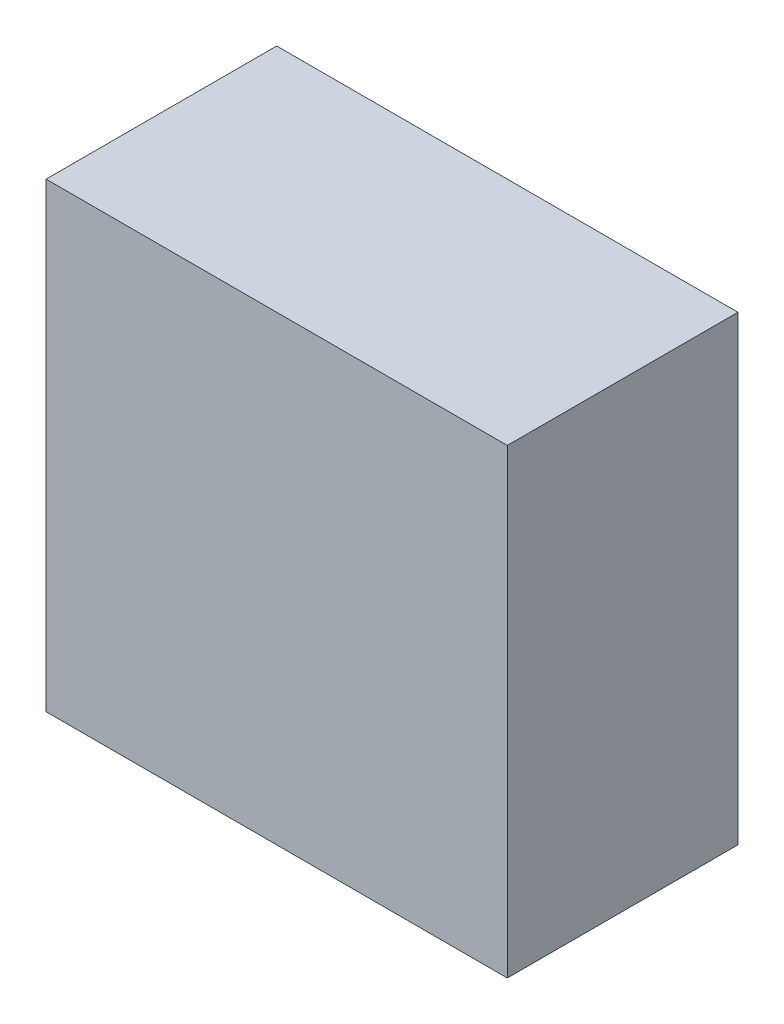
ISO-10303-21;
HEADER;
FILE_DESCRIPTION(('STEP AP214'),'2;1');
FILE_NAME('part.step','',(''),(''),'','','');
FILE_SCHEMA(('AUTOMOTIVE_DESIGN { 1 0 10303 214 1 1 1 1 }'));
ENDSEC;
DATA;
#1=APPLICATION_CONTEXT('core data for automotive mechanical design processes');
#2=APPLICATION_PROTOCOL_DEFINITION('international standard','automotive_design',2000,#1);
#3=PRODUCT_CONTEXT('',#1,'mechanical');
#4=PRODUCT('Part','Part','',(#3));
#5=PRODUCT_RELATED_PRODUCT_CATEGORY('part','',(#4));
#6=PRODUCT_DEFINITION_FORMATION('','',#4);
#7=PRODUCT_DEFINITION_CONTEXT('part definition',#1,'design');
#8=PRODUCT_DEFINITION('design','',#6,#7);
#9=PRODUCT_DEFINITION_SHAPE('','',#8);
#10=(LENGTH_UNIT() NAMED_UNIT(*) SI_UNIT(.MILLI.,.METRE.));
#11=(NAMED_UNIT(*) PLANE_ANGLE_UNIT() SI_UNIT($,.RADIAN.));
#12=(NAMED_UNIT(*) SI_UNIT($,.STERADIAN.) SOLID_ANGLE_UNIT());
#13=UNCERTAINTY_MEASURE_WITH_UNIT(LENGTH_MEASURE(1.E-05),#10,'distance_accuracy_value','');
#14=(GEOMETRIC_REPRESENTATION_CONTEXT(3) GLOBAL_UNCERTAINTY_ASSIGNED_CONTEXT((#13)) GLOBAL_UNIT_ASSIGNED_CONTEXT((#10,
#11,#12)) REPRESENTATION_CONTEXT('',''));
#15=CARTESIAN_POINT('',(0.,0.,0.));
#16=DIRECTION('',(0.,0.,1.));
#17=DIRECTION('',(1.,0.,0.));
#18=AXIS2_PLACEMENT_3D('',#15,#16,#17);
#19=CARTESIAN_POINT('',(0.,0.,2.75));
#20=DIRECTION('',(0.,0.,-1.));
#21=DIRECTION('',(-1.,0.,0.));
#22=AXIS2_PLACEMENT_3D('',#19,#20,#21);
#23=PLANE('',#22);
#24=DIRECTION('',(1.,0.,0.));
#25=VECTOR('',#24,1.);
#26=CARTESIAN_POINT('',(-118.,165.941489418563,2.75));
#27=LINE('',#26,#25);
#28=CARTESIAN_POINT('',(-122.,165.941489418563,2.75));
#29=VERTEX_POINT('',#28);
#30=CARTESIAN_POINT('',(-118.,165.941489418563,2.75));
#31=VERTEX_POINT('',#30);
#32=EDGE_CURVE('E80',#29,#31,#27,.T.);
#33=ORIENTED_EDGE('',*,*,#32,.T.);
#34=DIRECTION('',(0.,1.,0.));
#35=VECTOR('',#34,1.);
#36=CARTESIAN_POINT('',(-118.,169.941489418563,2.75));
#37=LINE('',#36,#35);
#38=CARTESIAN_POINT('',(-118.,169.941489418563,2.75));
#39=VERTEX_POINT('',#38);
#40=EDGE_CURVE('E55',#31,#39,#37,.T.);
#41=ORIENTED_EDGE('',*,*,#40,.T.);
#42=DIRECTION('',(1.,0.,0.));
#43=VECTOR('',#42,1.);
#44=CARTESIAN_POINT('',(-118.,169.941489418563,2.75));
#45=LINE('',#44,#43);
#46=CARTESIAN_POINT('',(-122.,169.941489418563,2.75));
#47=VERTEX_POINT('',#46);
#48=EDGE_CURVE('E57',#39,#47,#45,.F.);
#49=ORIENTED_EDGE('',*,*,#48,.T.);
#50=DIRECTION('',(0.,1.,0.));
#51=VECTOR('',#50,1.);
#52=CARTESIAN_POINT('',(-122.,169.941489418563,2.75));
#53=LINE('',#52,#51);
#54=EDGE_CURVE('E20',#47,#29,#53,.F.);
#55=ORIENTED_EDGE('',*,*,#54,.T.);
#56=EDGE_LOOP('',(#33,#41,#49,#55));
#57=FACE_BOUND('',#56,.T.);
#58=ADVANCED_FACE('F17',(#57),#23,.F.);
#59=CARTESIAN_POINT('',(-122.,169.941489418563,2.75));
#60=DIRECTION('',(1.,0.,0.));
#61=DIRECTION('',(0.,0.,-1.));
#62=AXIS2_PLACEMENT_3D('',#59,#60,#61);
#63=PLANE('',#62);
#64=DIRECTION('',(0.,0.,1.));
#65=VECTOR('',#64,1.);
#66=CARTESIAN_POINT('',(-122.,165.941489418563,2.75));
#67=LINE('',#66,#65);
#68=CARTESIAN_POINT('',(-122.,165.941489418563,0.75));
#69=VERTEX_POINT('',#68);
#70=EDGE_CURVE('E68',#69,#29,#67,.T.);
#71=ORIENTED_EDGE('',*,*,#70,.T.);
#72=ORIENTED_EDGE('',*,*,#54,.F.);
#73=DIRECTION('',(0.,0.,-1.));
#74=VECTOR('',#73,1.);
#75=CARTESIAN_POINT('',(-122.,169.941489418563,2.75));
#76=LINE('',#75,#74);
#77=CARTESIAN_POINT('',(-122.,169.941489418563,0.75));
#78=VERTEX_POINT('',#77);
#79=EDGE_CURVE('E63',#47,#78,#76,.T.);
#80=ORIENTED_EDGE('',*,*,#79,.T.);
#81=DIRECTION('',(0.,1.,0.));
#82=VECTOR('',#81,1.);
#83=CARTESIAN_POINT('',(-122.,0.,0.75));
#84=LINE('',#83,#82);
#85=EDGE_CURVE('E83',#69,#78,#84,.T.);
#86=ORIENTED_EDGE('',*,*,#85,.F.);
#87=EDGE_LOOP('',(#71,#72,#80,#86));
#88=FACE_BOUND('',#87,.T.);
#89=ADVANCED_FACE('F65',(#88),#63,.F.);
#90=CARTESIAN_POINT('',(-118.,169.941489418563,2.75));
#91=DIRECTION('',(0.,-1.,0.));
#92=DIRECTION('',(0.,0.,-1.));
#93=AXIS2_PLACEMENT_3D('',#90,#91,#92);
#94=PLANE('',#93);
#95=ORIENTED_EDGE('',*,*,#79,.F.);
#96=ORIENTED_EDGE('',*,*,#48,.F.);
#97=DIRECTION('',(0.,0.,1.));
#98=VECTOR('',#97,1.);
#99=CARTESIAN_POINT('',(-118.,169.941489418563,2.75));
#100=LINE('',#99,#98);
#101=CARTESIAN_POINT('',(-118.,169.941489418563,0.75));
#102=VERTEX_POINT('',#101);
#103=EDGE_CURVE('E75',#39,#102,#100,.F.);
#104=ORIENTED_EDGE('',*,*,#103,.T.);
#105=DIRECTION('',(-1.,0.,0.));
#106=VECTOR('',#105,1.);
#107=CARTESIAN_POINT('',(0.,169.941489418563,0.75));
#108=LINE('',#107,#106);
#109=EDGE_CURVE('E72',#78,#102,#108,.F.);
#110=ORIENTED_EDGE('',*,*,#109,.F.);
#111=EDGE_LOOP('',(#95,#96,#104,#110));
#112=FACE_BOUND('',#111,.T.);
#113=ADVANCED_FACE('F70',(#112),#94,.F.);
#114=CARTESIAN_POINT('',(-118.,169.941489418563,2.75));
#115=DIRECTION('',(-1.,0.,0.));
#116=DIRECTION('',(0.,0.,1.));
#117=AXIS2_PLACEMENT_3D('',#114,#115,#116);
#118=PLANE('',#117);
#119=ORIENTED_EDGE('',*,*,#103,.F.);
#120=ORIENTED_EDGE('',*,*,#40,.F.);
#121=DIRECTION('',(0.,0.,1.));
#122=VECTOR('',#121,1.);
#123=CARTESIAN_POINT('',(-118.,165.941489418563,2.75));
#124=LINE('',#123,#122);
#125=CARTESIAN_POINT('',(-118.,165.941489418563,0.75));
#126=VERTEX_POINT('',#125);
#127=EDGE_CURVE('E35',#31,#126,#124,.F.);
#128=ORIENTED_EDGE('',*,*,#127,.T.);
#129=DIRECTION('',(0.,1.,0.));
#130=VECTOR('',#129,1.);
#131=CARTESIAN_POINT('',(-118.,0.,0.75));
#132=LINE('',#131,#130);
#133=EDGE_CURVE('E26',#102,#126,#132,.F.);
#134=ORIENTED_EDGE('',*,*,#133,.F.);
#135=EDGE_LOOP('',(#119,#120,#128,#134));
#136=FACE_BOUND('',#135,.T.);
#137=ADVANCED_FACE('F89',(#136),#118,.F.);
#138=CARTESIAN_POINT('',(-118.,165.941489418563,2.75));
#139=DIRECTION('',(0.,1.,0.));
#140=DIRECTION('',(0.,0.,1.));
#141=AXIS2_PLACEMENT_3D('',#138,#139,#140);
#142=PLANE('',#141);
#143=ORIENTED_EDGE('',*,*,#127,.F.);
#144=ORIENTED_EDGE('',*,*,#32,.F.);
#145=ORIENTED_EDGE('',*,*,#70,.F.);
#146=DIRECTION('',(-1.,0.,0.));
#147=VECTOR('',#146,1.);
#148=CARTESIAN_POINT('',(0.,165.941489418563,0.75));
#149=LINE('',#148,#147);
#150=EDGE_CURVE('E11',#126,#69,#149,.T.);
#151=ORIENTED_EDGE('',*,*,#150,.F.);
#152=EDGE_LOOP('',(#143,#144,#145,#151));
#153=FACE_BOUND('',#152,.T.);
#154=ADVANCED_FACE('F91',(#153),#142,.F.);
#155=CARTESIAN_POINT('',(0.,0.,0.75));
#156=DIRECTION('',(0.,0.,-1.));
#157=DIRECTION('',(-1.,0.,0.));
#158=AXIS2_PLACEMENT_3D('',#155,#156,#157);
#159=PLANE('',#158);
#160=ORIENTED_EDGE('',*,*,#133,.T.);
#161=ORIENTED_EDGE('',*,*,#150,.T.);
#162=ORIENTED_EDGE('',*,*,#85,.T.);
#163=ORIENTED_EDGE('',*,*,#109,.T.);
#164=EDGE_LOOP('',(#160,#161,#162,#163));
#165=FACE_BOUND('',#164,.T.);
#166=ADVANCED_FACE('F88',(#165),#159,.T.);
#167=CLOSED_SHELL('',(#58,#89,#113,#137,#154,#166));
#168=MANIFOLD_SOLID_BREP('B1',#167);
#169=ADVANCED_BREP_SHAPE_REPRESENTATION('',(#18,#168),#14);
#170=SHAPE_DEFINITION_REPRESENTATION(#9,#169);
ENDSEC;
END-ISO-10303-21;
